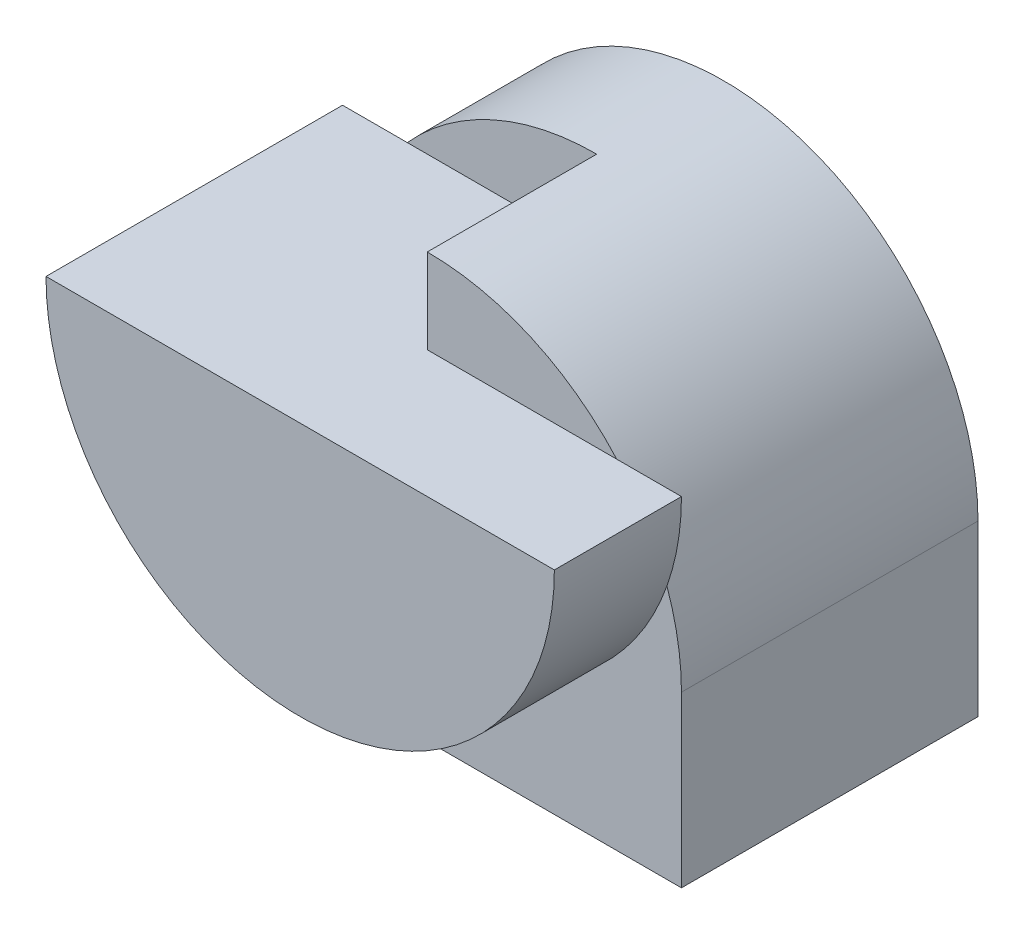
ISO-10303-21;
HEADER;
FILE_DESCRIPTION(('STEP AP214'),'2;1');
FILE_NAME('part.step','',(''),(''),'','','');
FILE_SCHEMA(('AUTOMOTIVE_DESIGN { 1 0 10303 214 1 1 1 1 }'));
ENDSEC;
DATA;
#1=APPLICATION_CONTEXT('core data for automotive mechanical design processes');
#2=APPLICATION_PROTOCOL_DEFINITION('international standard','automotive_design',2000,#1);
#3=PRODUCT_CONTEXT('',#1,'mechanical');
#4=PRODUCT('Part','Part','',(#3));
#5=PRODUCT_RELATED_PRODUCT_CATEGORY('part','',(#4));
#6=PRODUCT_DEFINITION_FORMATION('','',#4);
#7=PRODUCT_DEFINITION_CONTEXT('part definition',#1,'design');
#8=PRODUCT_DEFINITION('design','',#6,#7);
#9=PRODUCT_DEFINITION_SHAPE('','',#8);
#10=(LENGTH_UNIT() NAMED_UNIT(*) SI_UNIT(.MILLI.,.METRE.));
#11=(NAMED_UNIT(*) PLANE_ANGLE_UNIT() SI_UNIT($,.RADIAN.));
#12=(NAMED_UNIT(*) SI_UNIT($,.STERADIAN.) SOLID_ANGLE_UNIT());
#13=UNCERTAINTY_MEASURE_WITH_UNIT(LENGTH_MEASURE(1.E-05),#10,'distance_accuracy_value','');
#14=(GEOMETRIC_REPRESENTATION_CONTEXT(3) GLOBAL_UNCERTAINTY_ASSIGNED_CONTEXT((#13)) GLOBAL_UNIT_ASSIGNED_CONTEXT((#10,
#11,#12)) REPRESENTATION_CONTEXT('',''));
#15=CARTESIAN_POINT('',(0.,0.,0.));
#16=DIRECTION('',(0.,0.,1.));
#17=DIRECTION('',(1.,0.,0.));
#18=AXIS2_PLACEMENT_3D('',#15,#16,#17);
#19=CARTESIAN_POINT('',(0.,2.,1.5));
#20=DIRECTION('',(0.,0.,1.));
#21=DIRECTION('',(1.,0.,0.));
#22=AXIS2_PLACEMENT_3D('',#19,#20,#21);
#23=CYLINDRICAL_SURFACE('',#22,3.);
#24=CARTESIAN_POINT('',(0.,2.,3.5));
#25=DIRECTION('',(0.,0.,-1.));
#26=DIRECTION('',(-1.,0.,0.));
#27=AXIS2_PLACEMENT_3D('',#24,#25,#26);
#28=CIRCLE('',#27,3.);
#29=CARTESIAN_POINT('',(2.82842712474619,1.,3.5));
#30=VERTEX_POINT('',#29);
#31=CARTESIAN_POINT('',(0.,-1.,3.5));
#32=VERTEX_POINT('',#31);
#33=EDGE_CURVE('E141',#30,#32,#28,.T.);
#34=ORIENTED_EDGE('',*,*,#33,.F.);
#35=CARTESIAN_POINT('',(0.,2.,3.5));
#36=DIRECTION('',(0.,0.,-1.));
#37=DIRECTION('',(-1.,0.,0.));
#38=AXIS2_PLACEMENT_3D('',#35,#36,#37);
#39=CIRCLE('',#38,3.);
#40=CARTESIAN_POINT('',(3.,2.,3.5));
#41=VERTEX_POINT('',#40);
#42=EDGE_CURVE('E133',#41,#30,#39,.T.);
#43=ORIENTED_EDGE('',*,*,#42,.F.);
#44=DIRECTION('',(0.,0.,1.));
#45=VECTOR('',#44,1.);
#46=CARTESIAN_POINT('',(3.,2.,1.5));
#47=LINE('',#46,#45);
#48=CARTESIAN_POINT('',(3.,2.,5.));
#49=VERTEX_POINT('',#48);
#50=EDGE_CURVE('E385',#41,#49,#47,.T.);
#51=ORIENTED_EDGE('',*,*,#50,.T.);
#52=CARTESIAN_POINT('',(0.,2.,5.));
#53=DIRECTION('',(0.,0.,1.));
#54=DIRECTION('',(-1.,0.,0.));
#55=AXIS2_PLACEMENT_3D('',#52,#53,#54);
#56=CIRCLE('',#55,3.);
#57=CARTESIAN_POINT('',(-3.,2.,5.));
#58=VERTEX_POINT('',#57);
#59=EDGE_CURVE('E371',#58,#49,#56,.T.);
#60=ORIENTED_EDGE('',*,*,#59,.F.);
#61=DIRECTION('',(0.,0.,1.));
#62=VECTOR('',#61,1.);
#63=CARTESIAN_POINT('',(-3.,2.,1.5));
#64=LINE('',#63,#62);
#65=CARTESIAN_POINT('',(-3.,2.,1.5));
#66=VERTEX_POINT('',#65);
#67=EDGE_CURVE('E191',#66,#58,#64,.T.);
#68=ORIENTED_EDGE('',*,*,#67,.F.);
#69=CARTESIAN_POINT('',(0.,2.,1.5));
#70=DIRECTION('',(0.,0.,1.));
#71=DIRECTION('',(-1.,0.,0.));
#72=AXIS2_PLACEMENT_3D('',#69,#70,#71);
#73=CIRCLE('',#72,3.);
#74=CARTESIAN_POINT('',(-2.82842712474619,0.999999999999999,1.5));
#75=VERTEX_POINT('',#74);
#76=EDGE_CURVE('E379',#66,#75,#73,.T.);
#77=ORIENTED_EDGE('',*,*,#76,.T.);
#78=CARTESIAN_POINT('',(0.,-1.,1.5));
#79=VERTEX_POINT('',#78);
#80=EDGE_CURVE('E213',#75,#79,#73,.T.);
#81=ORIENTED_EDGE('',*,*,#80,.T.);
#82=DIRECTION('',(0.,0.,1.));
#83=VECTOR('',#82,1.);
#84=CARTESIAN_POINT('',(0.,-1.,1.5));
#85=LINE('',#84,#83);
#86=EDGE_CURVE('E11',#32,#79,#85,.F.);
#87=ORIENTED_EDGE('',*,*,#86,.F.);
#88=EDGE_LOOP('',(#34,#43,#51,#60,#68,#77,#81,#87));
#89=FACE_BOUND('',#88,.T.);
#90=ADVANCED_FACE('F33',(#89),#23,.T.);
#91=CARTESIAN_POINT('',(-3.,2.,1.5));
#92=DIRECTION('',(0.,1.,0.));
#93=DIRECTION('',(0.,0.,1.));
#94=AXIS2_PLACEMENT_3D('',#91,#92,#93);
#95=PLANE('',#94);
#96=ORIENTED_EDGE('',*,*,#50,.F.);
#97=DIRECTION('',(1.,0.,0.));
#98=VECTOR('',#97,1.);
#99=CARTESIAN_POINT('',(0.,2.,3.5));
#100=LINE('',#99,#98);
#101=CARTESIAN_POINT('',(2.23606797749979,2.,3.5));
#102=VERTEX_POINT('',#101);
#103=EDGE_CURVE('E132',#102,#41,#100,.T.);
#104=ORIENTED_EDGE('',*,*,#103,.F.);
#105=DIRECTION('',(1.,0.,0.));
#106=VECTOR('',#105,1.);
#107=CARTESIAN_POINT('',(0.,2.,3.5));
#108=LINE('',#107,#106);
#109=CARTESIAN_POINT('',(0.,2.,3.5));
#110=VERTEX_POINT('',#109);
#111=EDGE_CURVE('E48',#110,#102,#108,.T.);
#112=ORIENTED_EDGE('',*,*,#111,.F.);
#113=DIRECTION('',(0.,0.,1.));
#114=VECTOR('',#113,1.);
#115=CARTESIAN_POINT('',(0.,2.,1.5));
#116=LINE('',#115,#114);
#117=CARTESIAN_POINT('',(0.,2.,1.5));
#118=VERTEX_POINT('',#117);
#119=EDGE_CURVE('E41',#118,#110,#116,.T.);
#120=ORIENTED_EDGE('',*,*,#119,.F.);
#121=DIRECTION('',(-1.,0.,0.));
#122=VECTOR('',#121,1.);
#123=CARTESIAN_POINT('',(-3.,2.,1.5));
#124=LINE('',#123,#122);
#125=CARTESIAN_POINT('',(-2.23606797749979,2.,1.5));
#126=VERTEX_POINT('',#125);
#127=EDGE_CURVE('E384',#118,#126,#124,.T.);
#128=ORIENTED_EDGE('',*,*,#127,.T.);
#129=EDGE_CURVE('E382',#126,#66,#124,.T.);
#130=ORIENTED_EDGE('',*,*,#129,.T.);
#131=ORIENTED_EDGE('',*,*,#67,.T.);
#132=DIRECTION('',(-1.,0.,0.));
#133=VECTOR('',#132,1.);
#134=CARTESIAN_POINT('',(-3.,2.,5.));
#135=LINE('',#134,#133);
#136=EDGE_CURVE('E373',#49,#58,#135,.T.);
#137=ORIENTED_EDGE('',*,*,#136,.F.);
#138=EDGE_LOOP('',(#96,#104,#112,#120,#128,#130,#131,#137));
#139=FACE_BOUND('',#138,.T.);
#140=ADVANCED_FACE('F244',(#139),#95,.T.);
#141=CARTESIAN_POINT('',(0.,0.,3.5));
#142=DIRECTION('',(0.,0.,-1.));
#143=DIRECTION('',(-1.,0.,0.));
#144=AXIS2_PLACEMENT_3D('',#141,#142,#143);
#145=PLANE('',#144);
#146=CARTESIAN_POINT('',(0.,0.,3.5));
#147=DIRECTION('',(0.,0.,1.));
#148=DIRECTION('',(-1.,0.,0.));
#149=AXIS2_PLACEMENT_3D('',#146,#147,#148);
#150=CIRCLE('',#149,3.);
#151=CARTESIAN_POINT('',(3.,0.,3.5));
#152=VERTEX_POINT('',#151);
#153=EDGE_CURVE('E128',#152,#30,#150,.T.);
#154=ORIENTED_EDGE('',*,*,#153,.T.);
#155=ORIENTED_EDGE('',*,*,#33,.T.);
#156=DIRECTION('',(0.,-1.,0.));
#157=VECTOR('',#156,1.);
#158=CARTESIAN_POINT('',(0.,0.,3.5));
#159=LINE('',#158,#157);
#160=CARTESIAN_POINT('',(0.,-2.,3.5));
#161=VERTEX_POINT('',#160);
#162=EDGE_CURVE('E56',#32,#161,#159,.T.);
#163=ORIENTED_EDGE('',*,*,#162,.T.);
#164=DIRECTION('',(1.,0.,0.));
#165=VECTOR('',#164,1.);
#166=CARTESIAN_POINT('',(3.,-2.,3.5));
#167=LINE('',#166,#165);
#168=CARTESIAN_POINT('',(3.,-2.,3.5));
#169=VERTEX_POINT('',#168);
#170=EDGE_CURVE('E148',#161,#169,#167,.T.);
#171=ORIENTED_EDGE('',*,*,#170,.T.);
#172=DIRECTION('',(0.,1.,0.));
#173=VECTOR('',#172,1.);
#174=CARTESIAN_POINT('',(3.,0.,3.5));
#175=LINE('',#174,#173);
#176=EDGE_CURVE('E146',#169,#152,#175,.T.);
#177=ORIENTED_EDGE('',*,*,#176,.T.);
#178=EDGE_LOOP('',(#154,#155,#163,#171,#177));
#179=FACE_BOUND('',#178,.T.);
#180=ADVANCED_FACE('F144',(#179),#145,.F.);
#181=CARTESIAN_POINT('',(-3.,3.5,1.5));
#182=DIRECTION('',(0.,0.,-1.));
#183=DIRECTION('',(-1.,0.,0.));
#184=AXIS2_PLACEMENT_3D('',#181,#182,#183);
#185=PLANE('',#184);
#186=DIRECTION('',(0.,-1.,0.));
#187=VECTOR('',#186,1.);
#188=CARTESIAN_POINT('',(0.,3.5,1.5));
#189=LINE('',#188,#187);
#190=CARTESIAN_POINT('',(0.,-2.,1.5));
#191=VERTEX_POINT('',#190);
#192=EDGE_CURVE('E202',#79,#191,#189,.T.);
#193=ORIENTED_EDGE('',*,*,#192,.F.);
#194=ORIENTED_EDGE('',*,*,#80,.F.);
#195=CARTESIAN_POINT('',(0.,0.,1.5));
#196=DIRECTION('',(0.,0.,-1.));
#197=DIRECTION('',(-1.,0.,0.));
#198=AXIS2_PLACEMENT_3D('',#195,#196,#197);
#199=CIRCLE('',#198,3.);
#200=CARTESIAN_POINT('',(-3.,0.,1.5));
#201=VERTEX_POINT('',#200);
#202=EDGE_CURVE('E153',#201,#75,#199,.T.);
#203=ORIENTED_EDGE('',*,*,#202,.F.);
#204=DIRECTION('',(0.,-1.,0.));
#205=VECTOR('',#204,1.);
#206=CARTESIAN_POINT('',(-3.,3.5,1.5));
#207=LINE('',#206,#205);
#208=CARTESIAN_POINT('',(-3.,-2.,1.5));
#209=VERTEX_POINT('',#208);
#210=EDGE_CURVE('E199',#201,#209,#207,.T.);
#211=ORIENTED_EDGE('',*,*,#210,.T.);
#212=DIRECTION('',(1.,0.,0.));
#213=VECTOR('',#212,1.);
#214=CARTESIAN_POINT('',(-3.,-2.,1.5));
#215=LINE('',#214,#213);
#216=EDGE_CURVE('E142',#209,#191,#215,.T.);
#217=ORIENTED_EDGE('',*,*,#216,.T.);
#218=EDGE_LOOP('',(#193,#194,#203,#211,#217));
#219=FACE_BOUND('',#218,.T.);
#220=ADVANCED_FACE('F211',(#219),#185,.F.);
#221=CARTESIAN_POINT('',(0.,3.5,1.5));
#222=DIRECTION('',(1.,0.,0.));
#223=DIRECTION('',(0.,1.,0.));
#224=AXIS2_PLACEMENT_3D('',#221,#222,#223);
#225=PLANE('',#224);
#226=ORIENTED_EDGE('',*,*,#162,.F.);
#227=ORIENTED_EDGE('',*,*,#86,.T.);
#228=ORIENTED_EDGE('',*,*,#192,.T.);
#229=DIRECTION('',(0.,0.,1.));
#230=VECTOR('',#229,1.);
#231=CARTESIAN_POINT('',(0.,-2.,1.5));
#232=LINE('',#231,#230);
#233=EDGE_CURVE('E197',#191,#161,#232,.T.);
#234=ORIENTED_EDGE('',*,*,#233,.T.);
#235=EDGE_LOOP('',(#226,#227,#228,#234));
#236=FACE_BOUND('',#235,.T.);
#237=ADVANCED_FACE('F225',(#236),#225,.F.);
#238=CARTESIAN_POINT('',(0.,0.,3.5));
#239=DIRECTION('',(0.,0.,-1.));
#240=DIRECTION('',(-1.,0.,0.));
#241=AXIS2_PLACEMENT_3D('',#238,#239,#240);
#242=CYLINDRICAL_SURFACE('',#241,3.);
#243=CARTESIAN_POINT('',(0.,0.,3.5));
#244=DIRECTION('',(0.,0.,-1.));
#245=DIRECTION('',(-1.,0.,0.));
#246=AXIS2_PLACEMENT_3D('',#243,#244,#245);
#247=CIRCLE('',#246,3.);
#248=EDGE_CURVE('E124',#30,#102,#247,.F.);
#249=ORIENTED_EDGE('',*,*,#248,.F.);
#250=ORIENTED_EDGE('',*,*,#153,.F.);
#251=DIRECTION('',(0.,0.,-1.));
#252=VECTOR('',#251,1.);
#253=CARTESIAN_POINT('',(3.,0.,3.5));
#254=LINE('',#253,#252);
#255=CARTESIAN_POINT('',(3.,0.,0.));
#256=VERTEX_POINT('',#255);
#257=EDGE_CURVE('E157',#152,#256,#254,.T.);
#258=ORIENTED_EDGE('',*,*,#257,.T.);
#259=CARTESIAN_POINT('',(0.,0.,0.));
#260=DIRECTION('',(0.,0.,1.));
#261=DIRECTION('',(-1.,0.,0.));
#262=AXIS2_PLACEMENT_3D('',#259,#260,#261);
#263=CIRCLE('',#262,3.);
#264=CARTESIAN_POINT('',(-3.,0.,0.));
#265=VERTEX_POINT('',#264);
#266=EDGE_CURVE('E158',#256,#265,#263,.T.);
#267=ORIENTED_EDGE('',*,*,#266,.T.);
#268=DIRECTION('',(0.,0.,-1.));
#269=VECTOR('',#268,1.);
#270=CARTESIAN_POINT('',(-3.,0.,3.5));
#271=LINE('',#270,#269);
#272=EDGE_CURVE('E173',#201,#265,#271,.T.);
#273=ORIENTED_EDGE('',*,*,#272,.F.);
#274=ORIENTED_EDGE('',*,*,#202,.T.);
#275=CARTESIAN_POINT('',(0.,0.,1.5));
#276=DIRECTION('',(0.,0.,-1.));
#277=DIRECTION('',(-1.,0.,0.));
#278=AXIS2_PLACEMENT_3D('',#275,#276,#277);
#279=CIRCLE('',#278,3.);
#280=EDGE_CURVE('E188',#75,#126,#279,.T.);
#281=ORIENTED_EDGE('',*,*,#280,.T.);
#282=CARTESIAN_POINT('',(0.,3.,1.5));
#283=VERTEX_POINT('',#282);
#284=EDGE_CURVE('E203',#126,#283,#199,.T.);
#285=ORIENTED_EDGE('',*,*,#284,.T.);
#286=DIRECTION('',(0.,0.,-1.));
#287=VECTOR('',#286,1.);
#288=CARTESIAN_POINT('',(0.,3.,3.5));
#289=LINE('',#288,#287);
#290=CARTESIAN_POINT('',(0.,3.,3.5));
#291=VERTEX_POINT('',#290);
#292=EDGE_CURVE('E201',#283,#291,#289,.F.);
#293=ORIENTED_EDGE('',*,*,#292,.T.);
#294=EDGE_CURVE('E130',#102,#291,#150,.T.);
#295=ORIENTED_EDGE('',*,*,#294,.F.);
#296=EDGE_LOOP('',(#249,#250,#258,#267,#273,#274,#281,#285,#293,#295));
#297=FACE_BOUND('',#296,.T.);
#298=ADVANCED_FACE('F35',(#297),#242,.T.);
#299=CARTESIAN_POINT('',(-3.,-2.,3.5));
#300=DIRECTION('',(1.,0.,0.));
#301=DIRECTION('',(0.,1.,0.));
#302=AXIS2_PLACEMENT_3D('',#299,#300,#301);
#303=PLANE('',#302);
#304=DIRECTION('',(0.,0.,-1.));
#305=VECTOR('',#304,1.);
#306=CARTESIAN_POINT('',(-3.,-2.,3.5));
#307=LINE('',#306,#305);
#308=CARTESIAN_POINT('',(-3.,-2.,0.));
#309=VERTEX_POINT('',#308);
#310=EDGE_CURVE('E171',#209,#309,#307,.T.);
#311=ORIENTED_EDGE('',*,*,#310,.F.);
#312=ORIENTED_EDGE('',*,*,#210,.F.);
#313=ORIENTED_EDGE('',*,*,#272,.T.);
#314=DIRECTION('',(0.,-1.,0.));
#315=VECTOR('',#314,1.);
#316=CARTESIAN_POINT('',(-3.,-2.,0.));
#317=LINE('',#316,#315);
#318=EDGE_CURVE('E161',#265,#309,#317,.T.);
#319=ORIENTED_EDGE('',*,*,#318,.T.);
#320=EDGE_LOOP('',(#311,#312,#313,#319));
#321=FACE_BOUND('',#320,.T.);
#322=ADVANCED_FACE('F216',(#321),#303,.F.);
#323=CARTESIAN_POINT('',(3.,-2.,3.5));
#324=DIRECTION('',(0.,1.,0.));
#325=DIRECTION('',(-1.,0.,0.));
#326=AXIS2_PLACEMENT_3D('',#323,#324,#325);
#327=PLANE('',#326);
#328=ORIENTED_EDGE('',*,*,#170,.F.);
#329=ORIENTED_EDGE('',*,*,#233,.F.);
#330=ORIENTED_EDGE('',*,*,#216,.F.);
#331=ORIENTED_EDGE('',*,*,#310,.T.);
#332=DIRECTION('',(1.,0.,0.));
#333=VECTOR('',#332,1.);
#334=CARTESIAN_POINT('',(3.,-2.,0.));
#335=LINE('',#334,#333);
#336=CARTESIAN_POINT('',(3.,-2.,0.));
#337=VERTEX_POINT('',#336);
#338=EDGE_CURVE('E164',#309,#337,#335,.T.);
#339=ORIENTED_EDGE('',*,*,#338,.T.);
#340=DIRECTION('',(0.,0.,-1.));
#341=VECTOR('',#340,1.);
#342=CARTESIAN_POINT('',(3.,-2.,3.5));
#343=LINE('',#342,#341);
#344=EDGE_CURVE('E168',#169,#337,#343,.T.);
#345=ORIENTED_EDGE('',*,*,#344,.F.);
#346=EDGE_LOOP('',(#328,#329,#330,#331,#339,#345));
#347=FACE_BOUND('',#346,.T.);
#348=ADVANCED_FACE('F221',(#347),#327,.F.);
#349=CARTESIAN_POINT('',(3.,0.,3.5));
#350=DIRECTION('',(-1.,0.,0.));
#351=DIRECTION('',(0.,-1.,0.));
#352=AXIS2_PLACEMENT_3D('',#349,#350,#351);
#353=PLANE('',#352);
#354=DIRECTION('',(0.,1.,0.));
#355=VECTOR('',#354,1.);
#356=CARTESIAN_POINT('',(3.,0.,0.));
#357=LINE('',#356,#355);
#358=EDGE_CURVE('E151',#337,#256,#357,.T.);
#359=ORIENTED_EDGE('',*,*,#358,.T.);
#360=ORIENTED_EDGE('',*,*,#257,.F.);
#361=ORIENTED_EDGE('',*,*,#176,.F.);
#362=ORIENTED_EDGE('',*,*,#344,.T.);
#363=EDGE_LOOP('',(#359,#360,#361,#362));
#364=FACE_BOUND('',#363,.T.);
#365=ADVANCED_FACE('F228',(#364),#353,.F.);
#366=EDGE_CURVE('E175',#291,#110,#159,.T.);
#367=ORIENTED_EDGE('',*,*,#366,.T.);
#368=ORIENTED_EDGE('',*,*,#111,.T.);
#369=ORIENTED_EDGE('',*,*,#294,.T.);
#370=EDGE_LOOP('',(#367,#368,#369));
#371=FACE_BOUND('',#370,.T.);
#372=ADVANCED_FACE('F187',(#371),#145,.F.);
#373=CARTESIAN_POINT('',(0.,0.,0.));
#374=DIRECTION('',(0.,0.,-1.));
#375=DIRECTION('',(-1.,0.,0.));
#376=AXIS2_PLACEMENT_3D('',#373,#374,#375);
#377=PLANE('',#376);
#378=ORIENTED_EDGE('',*,*,#266,.F.);
#379=ORIENTED_EDGE('',*,*,#358,.F.);
#380=ORIENTED_EDGE('',*,*,#338,.F.);
#381=ORIENTED_EDGE('',*,*,#318,.F.);
#382=EDGE_LOOP('',(#378,#379,#380,#381));
#383=FACE_BOUND('',#382,.T.);
#384=ADVANCED_FACE('F231',(#383),#377,.T.);
#385=ORIENTED_EDGE('',*,*,#284,.F.);
#386=ORIENTED_EDGE('',*,*,#127,.F.);
#387=EDGE_CURVE('E183',#283,#118,#189,.T.);
#388=ORIENTED_EDGE('',*,*,#387,.F.);
#389=EDGE_LOOP('',(#385,#386,#388));
#390=FACE_BOUND('',#389,.T.);
#391=ADVANCED_FACE('F233',(#390),#185,.F.);
#392=ORIENTED_EDGE('',*,*,#387,.T.);
#393=ORIENTED_EDGE('',*,*,#119,.T.);
#394=ORIENTED_EDGE('',*,*,#366,.F.);
#395=ORIENTED_EDGE('',*,*,#292,.F.);
#396=EDGE_LOOP('',(#392,#393,#394,#395));
#397=FACE_BOUND('',#396,.T.);
#398=ADVANCED_FACE('F180',(#397),#225,.F.);
#399=CARTESIAN_POINT('',(0.,2.,1.5));
#400=DIRECTION('',(0.,0.,-1.));
#401=DIRECTION('',(-1.,0.,0.));
#402=AXIS2_PLACEMENT_3D('',#399,#400,#401);
#403=PLANE('',#402);
#404=ORIENTED_EDGE('',*,*,#280,.F.);
#405=ORIENTED_EDGE('',*,*,#76,.F.);
#406=ORIENTED_EDGE('',*,*,#129,.F.);
#407=EDGE_LOOP('',(#404,#405,#406));
#408=FACE_BOUND('',#407,.T.);
#409=ADVANCED_FACE('F253',(#408),#403,.T.);
#410=CARTESIAN_POINT('',(0.,2.,5.));
#411=DIRECTION('',(0.,0.,-1.));
#412=DIRECTION('',(-1.,0.,0.));
#413=AXIS2_PLACEMENT_3D('',#410,#411,#412);
#414=PLANE('',#413);
#415=ORIENTED_EDGE('',*,*,#59,.T.);
#416=ORIENTED_EDGE('',*,*,#136,.T.);
#417=EDGE_LOOP('',(#415,#416));
#418=FACE_BOUND('',#417,.T.);
#419=ADVANCED_FACE('F257',(#418),#414,.F.);
#420=CARTESIAN_POINT('',(0.,0.,3.5));
#421=DIRECTION('',(0.,0.,-1.));
#422=DIRECTION('',(-1.,0.,0.));
#423=AXIS2_PLACEMENT_3D('',#420,#421,#422);
#424=PLANE('',#423);
#425=ORIENTED_EDGE('',*,*,#42,.T.);
#426=ORIENTED_EDGE('',*,*,#248,.T.);
#427=ORIENTED_EDGE('',*,*,#103,.T.);
#428=EDGE_LOOP('',(#425,#426,#427));
#429=FACE_BOUND('',#428,.T.);
#430=ADVANCED_FACE('F137',(#429),#424,.T.);
#431=CLOSED_SHELL('',(#90,#140,#180,#220,#237,#298,#322,#348,#365,#372,#384,#391,#398,#409,#419,#430));
#432=MANIFOLD_SOLID_BREP('B2',#431);
#433=ADVANCED_BREP_SHAPE_REPRESENTATION('',(#18,#432),#14);
#434=SHAPE_DEFINITION_REPRESENTATION(#9,#433);
ENDSEC;
END-ISO-10303-21;
